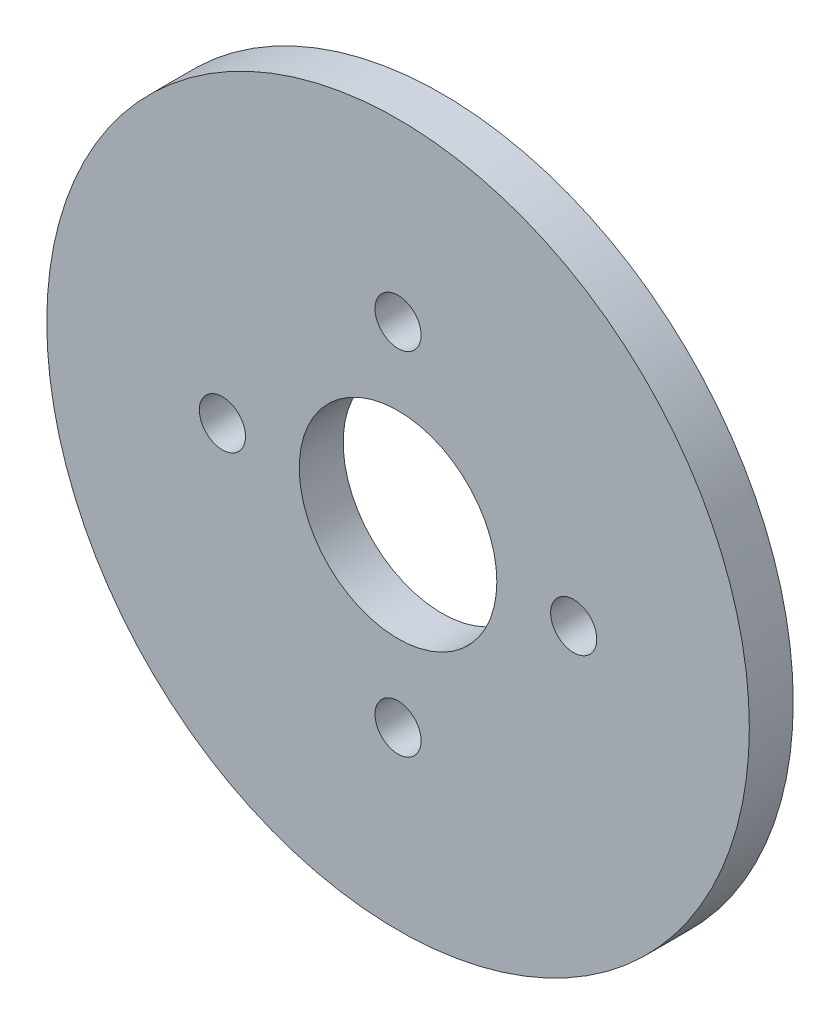
ISO-10303-21;
HEADER;
FILE_DESCRIPTION(('STEP AP214'),'2;1');
FILE_NAME('part.step','',(''),(''),'','','');
FILE_SCHEMA(('AUTOMOTIVE_DESIGN { 1 0 10303 214 1 1 1 1 }'));
ENDSEC;
DATA;
#1=APPLICATION_CONTEXT('core data for automotive mechanical design processes');
#2=APPLICATION_PROTOCOL_DEFINITION('international standard','automotive_design',2000,#1);
#3=PRODUCT_CONTEXT('',#1,'mechanical');
#4=PRODUCT('Part','Part','',(#3));
#5=PRODUCT_RELATED_PRODUCT_CATEGORY('part','',(#4));
#6=PRODUCT_DEFINITION_FORMATION('','',#4);
#7=PRODUCT_DEFINITION_CONTEXT('part definition',#1,'design');
#8=PRODUCT_DEFINITION('design','',#6,#7);
#9=PRODUCT_DEFINITION_SHAPE('','',#8);
#10=(LENGTH_UNIT() NAMED_UNIT(*) SI_UNIT(.MILLI.,.METRE.));
#11=(NAMED_UNIT(*) PLANE_ANGLE_UNIT() SI_UNIT($,.RADIAN.));
#12=(NAMED_UNIT(*) SI_UNIT($,.STERADIAN.) SOLID_ANGLE_UNIT());
#13=UNCERTAINTY_MEASURE_WITH_UNIT(LENGTH_MEASURE(1.E-05),#10,'distance_accuracy_value','');
#14=(GEOMETRIC_REPRESENTATION_CONTEXT(3) GLOBAL_UNCERTAINTY_ASSIGNED_CONTEXT((#13)) GLOBAL_UNIT_ASSIGNED_CONTEXT((#10,
#11,#12)) REPRESENTATION_CONTEXT('',''));
#15=CARTESIAN_POINT('',(0.,0.,0.));
#16=DIRECTION('',(0.,0.,1.));
#17=DIRECTION('',(1.,0.,0.));
#18=AXIS2_PLACEMENT_3D('',#15,#16,#17);
#19=CARTESIAN_POINT('',(0.,0.,2.));
#20=DIRECTION('',(0.,0.,1.));
#21=DIRECTION('',(1.,0.,0.));
#22=AXIS2_PLACEMENT_3D('',#19,#20,#21);
#23=PLANE('',#22);
#24=CARTESIAN_POINT('',(4.51808198568511E-13,-8.,2.));
#25=DIRECTION('',(0.,0.,1.));
#26=DIRECTION('',(1.,0.,0.));
#27=AXIS2_PLACEMENT_3D('',#24,#25,#26);
#28=CIRCLE('',#27,1.05000000000049);
#29=CARTESIAN_POINT('',(1.05000000000094,-8.,2.));
#30=VERTEX_POINT('',#29);
#31=EDGE_CURVE('E60',#30,#30,#28,.T.);
#32=ORIENTED_EDGE('',*,*,#31,.F.);
#33=EDGE_LOOP('',(#32));
#34=FACE_BOUND('',#33,.T.);
#35=CARTESIAN_POINT('',(0.,8.,2.));
#36=DIRECTION('',(0.,0.,1.));
#37=DIRECTION('',(1.,0.,0.));
#38=AXIS2_PLACEMENT_3D('',#35,#36,#37);
#39=CIRCLE('',#38,1.05);
#40=CARTESIAN_POINT('',(1.05,8.,2.));
#41=VERTEX_POINT('',#40);
#42=EDGE_CURVE('E48',#41,#41,#39,.T.);
#43=ORIENTED_EDGE('',*,*,#42,.F.);
#44=EDGE_LOOP('',(#43));
#45=FACE_BOUND('',#44,.T.);
#46=CARTESIAN_POINT('',(0.,0.,2.));
#47=DIRECTION('',(0.,0.,1.));
#48=DIRECTION('',(1.,0.,0.));
#49=AXIS2_PLACEMENT_3D('',#46,#47,#48);
#50=CIRCLE('',#49,16.);
#51=CARTESIAN_POINT('',(16.,0.,2.));
#52=VERTEX_POINT('',#51);
#53=EDGE_CURVE('E10',#52,#52,#50,.T.);
#54=ORIENTED_EDGE('',*,*,#53,.T.);
#55=EDGE_LOOP('',(#54));
#56=FACE_BOUND('',#55,.T.);
#57=CARTESIAN_POINT('',(0.,0.,2.));
#58=DIRECTION('',(0.,0.,1.));
#59=DIRECTION('',(1.,0.,0.));
#60=AXIS2_PLACEMENT_3D('',#57,#58,#59);
#61=CIRCLE('',#60,4.5);
#62=CARTESIAN_POINT('',(4.5,0.,2.));
#63=VERTEX_POINT('',#62);
#64=EDGE_CURVE('E43',#63,#63,#61,.T.);
#65=ORIENTED_EDGE('',*,*,#64,.F.);
#66=EDGE_LOOP('',(#65));
#67=FACE_BOUND('',#66,.T.);
#68=CARTESIAN_POINT('',(8.00000000000023,2.25904099284255E-13,2.));
#69=DIRECTION('',(0.,0.,1.));
#70=DIRECTION('',(1.,0.,0.));
#71=AXIS2_PLACEMENT_3D('',#68,#69,#70);
#72=CIRCLE('',#71,1.05000000000018);
#73=CARTESIAN_POINT('',(9.0500000000004,2.25904099284255E-13,2.));
#74=VERTEX_POINT('',#73);
#75=EDGE_CURVE('E54',#74,#74,#72,.T.);
#76=ORIENTED_EDGE('',*,*,#75,.F.);
#77=EDGE_LOOP('',(#76));
#78=FACE_BOUND('',#77,.T.);
#79=CARTESIAN_POINT('',(-7.99999999999977,-2.26883816723573E-13,2.));
#80=DIRECTION('',(0.,0.,1.));
#81=DIRECTION('',(1.,0.,0.));
#82=AXIS2_PLACEMENT_3D('',#79,#80,#81);
#83=CIRCLE('',#82,1.05000000000036);
#84=CARTESIAN_POINT('',(-6.94999999999941,-2.26883816723573E-13,2.));
#85=VERTEX_POINT('',#84);
#86=EDGE_CURVE('E66',#85,#85,#83,.T.);
#87=ORIENTED_EDGE('',*,*,#86,.F.);
#88=EDGE_LOOP('',(#87));
#89=FACE_BOUND('',#88,.T.);
#90=ADVANCED_FACE('F32',(#34,#45,#56,#67,#78,#89),#23,.T.);
#91=CARTESIAN_POINT('',(0.,0.,0.));
#92=DIRECTION('',(0.,0.,1.));
#93=DIRECTION('',(1.,0.,0.));
#94=AXIS2_PLACEMENT_3D('',#91,#92,#93);
#95=PLANE('',#94);
#96=CARTESIAN_POINT('',(0.,0.,0.));
#97=DIRECTION('',(0.,0.,1.));
#98=DIRECTION('',(1.,0.,0.));
#99=AXIS2_PLACEMENT_3D('',#96,#97,#98);
#100=CIRCLE('',#99,16.);
#101=CARTESIAN_POINT('',(16.,0.,0.));
#102=VERTEX_POINT('',#101);
#103=EDGE_CURVE('E36',#102,#102,#100,.T.);
#104=ORIENTED_EDGE('',*,*,#103,.F.);
#105=EDGE_LOOP('',(#104));
#106=FACE_BOUND('',#105,.T.);
#107=CARTESIAN_POINT('',(0.,0.,0.));
#108=DIRECTION('',(0.,0.,1.));
#109=DIRECTION('',(1.,0.,0.));
#110=AXIS2_PLACEMENT_3D('',#107,#108,#109);
#111=CIRCLE('',#110,4.5);
#112=CARTESIAN_POINT('',(4.5,0.,0.));
#113=VERTEX_POINT('',#112);
#114=EDGE_CURVE('E45',#113,#113,#111,.T.);
#115=ORIENTED_EDGE('',*,*,#114,.T.);
#116=EDGE_LOOP('',(#115));
#117=FACE_BOUND('',#116,.T.);
#118=CARTESIAN_POINT('',(0.,8.,0.));
#119=DIRECTION('',(0.,0.,1.));
#120=DIRECTION('',(1.,0.,0.));
#121=AXIS2_PLACEMENT_3D('',#118,#119,#120);
#122=CIRCLE('',#121,1.05);
#123=CARTESIAN_POINT('',(1.05,8.,0.));
#124=VERTEX_POINT('',#123);
#125=EDGE_CURVE('E51',#124,#124,#122,.T.);
#126=ORIENTED_EDGE('',*,*,#125,.T.);
#127=EDGE_LOOP('',(#126));
#128=FACE_BOUND('',#127,.T.);
#129=CARTESIAN_POINT('',(8.00000000000023,2.25904099284255E-13,0.));
#130=DIRECTION('',(0.,0.,1.));
#131=DIRECTION('',(1.,0.,0.));
#132=AXIS2_PLACEMENT_3D('',#129,#130,#131);
#133=CIRCLE('',#132,1.05000000000018);
#134=CARTESIAN_POINT('',(9.0500000000004,2.25904099284255E-13,0.));
#135=VERTEX_POINT('',#134);
#136=EDGE_CURVE('E57',#135,#135,#133,.T.);
#137=ORIENTED_EDGE('',*,*,#136,.T.);
#138=EDGE_LOOP('',(#137));
#139=FACE_BOUND('',#138,.T.);
#140=CARTESIAN_POINT('',(4.51808198568511E-13,-8.,0.));
#141=DIRECTION('',(0.,0.,1.));
#142=DIRECTION('',(1.,0.,0.));
#143=AXIS2_PLACEMENT_3D('',#140,#141,#142);
#144=CIRCLE('',#143,1.05000000000049);
#145=CARTESIAN_POINT('',(1.05000000000094,-8.,0.));
#146=VERTEX_POINT('',#145);
#147=EDGE_CURVE('E63',#146,#146,#144,.T.);
#148=ORIENTED_EDGE('',*,*,#147,.T.);
#149=EDGE_LOOP('',(#148));
#150=FACE_BOUND('',#149,.T.);
#151=CARTESIAN_POINT('',(-7.99999999999977,-2.26883816723573E-13,0.));
#152=DIRECTION('',(0.,0.,1.));
#153=DIRECTION('',(1.,0.,0.));
#154=AXIS2_PLACEMENT_3D('',#151,#152,#153);
#155=CIRCLE('',#154,1.05000000000036);
#156=CARTESIAN_POINT('',(-6.94999999999941,-2.26883816723573E-13,0.));
#157=VERTEX_POINT('',#156);
#158=EDGE_CURVE('E69',#157,#157,#155,.T.);
#159=ORIENTED_EDGE('',*,*,#158,.T.);
#160=EDGE_LOOP('',(#159));
#161=FACE_BOUND('',#160,.T.);
#162=ADVANCED_FACE('F79',(#106,#117,#128,#139,#150,#161),#95,.F.);
#163=CARTESIAN_POINT('',(0.,0.,2.));
#164=DIRECTION('',(0.,0.,-1.));
#165=DIRECTION('',(-1.,0.,0.));
#166=AXIS2_PLACEMENT_3D('',#163,#164,#165);
#167=CYLINDRICAL_SURFACE('',#166,16.);
#168=ORIENTED_EDGE('',*,*,#53,.F.);
#169=EDGE_LOOP('',(#168));
#170=FACE_BOUND('',#169,.T.);
#171=ORIENTED_EDGE('',*,*,#103,.T.);
#172=EDGE_LOOP('',(#171));
#173=FACE_BOUND('',#172,.T.);
#174=ADVANCED_FACE('F34',(#170,#173),#167,.T.);
#175=CARTESIAN_POINT('',(0.,0.,2.));
#176=DIRECTION('',(0.,0.,-1.));
#177=DIRECTION('',(-1.,0.,0.));
#178=AXIS2_PLACEMENT_3D('',#175,#176,#177);
#179=CYLINDRICAL_SURFACE('',#178,4.5);
#180=ORIENTED_EDGE('',*,*,#64,.T.);
#181=EDGE_LOOP('',(#180));
#182=FACE_BOUND('',#181,.T.);
#183=ORIENTED_EDGE('',*,*,#114,.F.);
#184=EDGE_LOOP('',(#183));
#185=FACE_BOUND('',#184,.T.);
#186=ADVANCED_FACE('F89',(#182,#185),#179,.F.);
#187=CARTESIAN_POINT('',(0.,8.,2.));
#188=DIRECTION('',(0.,0.,-1.));
#189=DIRECTION('',(-1.,0.,0.));
#190=AXIS2_PLACEMENT_3D('',#187,#188,#189);
#191=CYLINDRICAL_SURFACE('',#190,1.05);
#192=ORIENTED_EDGE('',*,*,#42,.T.);
#193=EDGE_LOOP('',(#192));
#194=FACE_BOUND('',#193,.T.);
#195=ORIENTED_EDGE('',*,*,#125,.F.);
#196=EDGE_LOOP('',(#195));
#197=FACE_BOUND('',#196,.T.);
#198=ADVANCED_FACE('F92',(#194,#197),#191,.F.);
#199=CARTESIAN_POINT('',(8.00000000000023,2.25904099284255E-13,2.));
#200=DIRECTION('',(0.,0.,-1.));
#201=DIRECTION('',(-1.,0.,0.));
#202=AXIS2_PLACEMENT_3D('',#199,#200,#201);
#203=CYLINDRICAL_SURFACE('',#202,1.05000000000018);
#204=ORIENTED_EDGE('',*,*,#75,.T.);
#205=EDGE_LOOP('',(#204));
#206=FACE_BOUND('',#205,.T.);
#207=ORIENTED_EDGE('',*,*,#136,.F.);
#208=EDGE_LOOP('',(#207));
#209=FACE_BOUND('',#208,.T.);
#210=ADVANCED_FACE('F96',(#206,#209),#203,.F.);
#211=CARTESIAN_POINT('',(4.51808198568511E-13,-8.,2.));
#212=DIRECTION('',(0.,0.,-1.));
#213=DIRECTION('',(-1.,0.,0.));
#214=AXIS2_PLACEMENT_3D('',#211,#212,#213);
#215=CYLINDRICAL_SURFACE('',#214,1.05000000000049);
#216=ORIENTED_EDGE('',*,*,#31,.T.);
#217=EDGE_LOOP('',(#216));
#218=FACE_BOUND('',#217,.T.);
#219=ORIENTED_EDGE('',*,*,#147,.F.);
#220=EDGE_LOOP('',(#219));
#221=FACE_BOUND('',#220,.T.);
#222=ADVANCED_FACE('F100',(#218,#221),#215,.F.);
#223=CARTESIAN_POINT('',(-7.99999999999977,-2.26883816723573E-13,2.));
#224=DIRECTION('',(0.,0.,-1.));
#225=DIRECTION('',(-1.,0.,0.));
#226=AXIS2_PLACEMENT_3D('',#223,#224,#225);
#227=CYLINDRICAL_SURFACE('',#226,1.05000000000036);
#228=ORIENTED_EDGE('',*,*,#86,.T.);
#229=EDGE_LOOP('',(#228));
#230=FACE_BOUND('',#229,.T.);
#231=ORIENTED_EDGE('',*,*,#158,.F.);
#232=EDGE_LOOP('',(#231));
#233=FACE_BOUND('',#232,.T.);
#234=ADVANCED_FACE('F75',(#230,#233),#227,.F.);
#235=CLOSED_SHELL('',(#90,#162,#174,#186,#198,#210,#222,#234));
#236=MANIFOLD_SOLID_BREP('B2',#235);
#237=ADVANCED_BREP_SHAPE_REPRESENTATION('',(#18,#236),#14);
#238=SHAPE_DEFINITION_REPRESENTATION(#9,#237);
ENDSEC;
END-ISO-10303-21;
